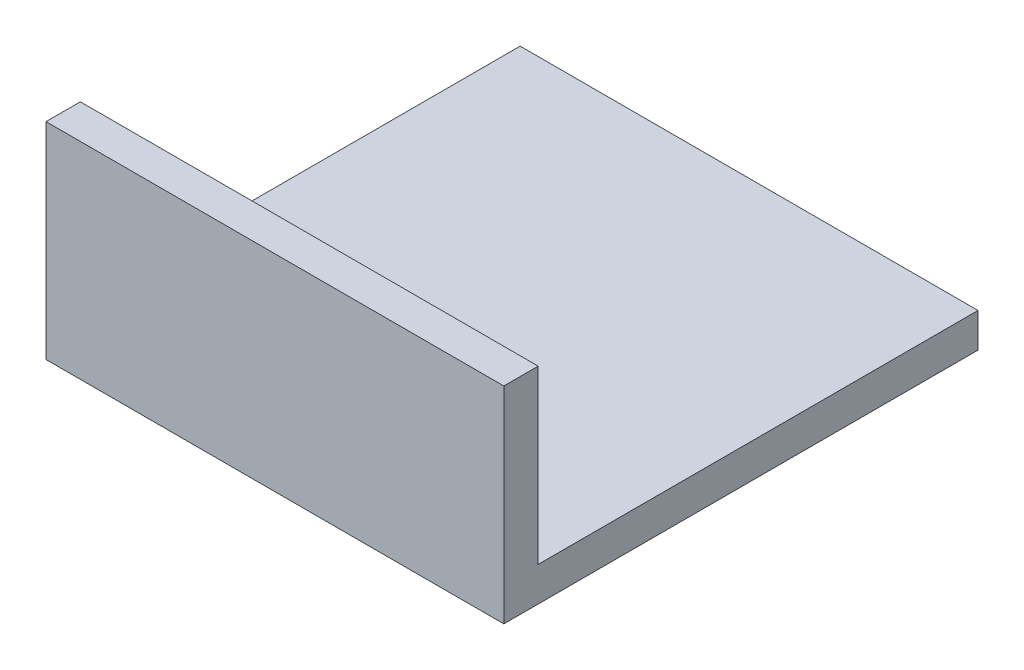
ISO-10303-21;
HEADER;
FILE_DESCRIPTION(('STEP AP214'),'2;1');
FILE_NAME('part.step','',(''),(''),'','','');
FILE_SCHEMA(('AUTOMOTIVE_DESIGN { 1 0 10303 214 1 1 1 1 }'));
ENDSEC;
DATA;
#1=APPLICATION_CONTEXT('core data for automotive mechanical design processes');
#2=APPLICATION_PROTOCOL_DEFINITION('international standard','automotive_design',2000,#1);
#3=PRODUCT_CONTEXT('',#1,'mechanical');
#4=PRODUCT('Part','Part','',(#3));
#5=PRODUCT_RELATED_PRODUCT_CATEGORY('part','',(#4));
#6=PRODUCT_DEFINITION_FORMATION('','',#4);
#7=PRODUCT_DEFINITION_CONTEXT('part definition',#1,'design');
#8=PRODUCT_DEFINITION('design','',#6,#7);
#9=PRODUCT_DEFINITION_SHAPE('','',#8);
#10=(LENGTH_UNIT() NAMED_UNIT(*) SI_UNIT(.MILLI.,.METRE.));
#11=(NAMED_UNIT(*) PLANE_ANGLE_UNIT() SI_UNIT($,.RADIAN.));
#12=(NAMED_UNIT(*) SI_UNIT($,.STERADIAN.) SOLID_ANGLE_UNIT());
#13=UNCERTAINTY_MEASURE_WITH_UNIT(LENGTH_MEASURE(1.E-05),#10,'distance_accuracy_value','');
#14=(GEOMETRIC_REPRESENTATION_CONTEXT(3) GLOBAL_UNCERTAINTY_ASSIGNED_CONTEXT((#13)) GLOBAL_UNIT_ASSIGNED_CONTEXT((#10,
#11,#12)) REPRESENTATION_CONTEXT('',''));
#15=CARTESIAN_POINT('',(0.,0.,0.));
#16=DIRECTION('',(0.,0.,1.));
#17=DIRECTION('',(1.,0.,0.));
#18=AXIS2_PLACEMENT_3D('',#15,#16,#17);
#19=CARTESIAN_POINT('',(0.,0.,0.));
#20=DIRECTION('',(0.,0.,-1.));
#21=DIRECTION('',(-1.,0.,0.));
#22=AXIS2_PLACEMENT_3D('',#19,#20,#21);
#23=PLANE('',#22);
#24=DIRECTION('',(0.,1.,0.));
#25=VECTOR('',#24,1.);
#26=CARTESIAN_POINT('',(127.,0.,0.));
#27=LINE('',#26,#25);
#28=CARTESIAN_POINT('',(127.,9.525,0.));
#29=VERTEX_POINT('',#28);
#30=CARTESIAN_POINT('',(127.,57.15,0.));
#31=VERTEX_POINT('',#30);
#32=EDGE_CURVE('E62',#29,#31,#27,.T.);
#33=ORIENTED_EDGE('',*,*,#32,.F.);
#34=DIRECTION('',(-1.,0.,0.));
#35=VECTOR('',#34,1.);
#36=CARTESIAN_POINT('',(0.,9.525,0.));
#37=LINE('',#36,#35);
#38=CARTESIAN_POINT('',(0.,9.525,0.));
#39=VERTEX_POINT('',#38);
#40=EDGE_CURVE('E11',#29,#39,#37,.T.);
#41=ORIENTED_EDGE('',*,*,#40,.T.);
#42=DIRECTION('',(0.,-1.,0.));
#43=VECTOR('',#42,1.);
#44=CARTESIAN_POINT('',(0.,0.,0.));
#45=LINE('',#44,#43);
#46=CARTESIAN_POINT('',(0.,57.15,0.));
#47=VERTEX_POINT('',#46);
#48=EDGE_CURVE('E106',#47,#39,#45,.T.);
#49=ORIENTED_EDGE('',*,*,#48,.F.);
#50=DIRECTION('',(-1.,0.,0.));
#51=VECTOR('',#50,1.);
#52=CARTESIAN_POINT('',(0.,57.15,0.));
#53=LINE('',#52,#51);
#54=EDGE_CURVE('E111',#31,#47,#53,.T.);
#55=ORIENTED_EDGE('',*,*,#54,.F.);
#56=EDGE_LOOP('',(#33,#41,#49,#55));
#57=FACE_BOUND('',#56,.T.);
#58=ADVANCED_FACE('F33',(#57),#23,.T.);
#59=CARTESIAN_POINT('',(0.,0.,9.525));
#60=DIRECTION('',(1.,0.,0.));
#61=DIRECTION('',(0.,0.,-1.));
#62=AXIS2_PLACEMENT_3D('',#59,#60,#61);
#63=PLANE('',#62);
#64=DIRECTION('',(0.,-1.,0.));
#65=VECTOR('',#64,1.);
#66=CARTESIAN_POINT('',(0.,9.525,-121.9962));
#67=LINE('',#66,#65);
#68=CARTESIAN_POINT('',(0.,9.525,-121.9962));
#69=VERTEX_POINT('',#68);
#70=CARTESIAN_POINT('',(0.,0.,-121.9962));
#71=VERTEX_POINT('',#70);
#72=EDGE_CURVE('E123',#69,#71,#67,.T.);
#73=ORIENTED_EDGE('',*,*,#72,.T.);
#74=DIRECTION('',(0.,0.,-1.));
#75=VECTOR('',#74,1.);
#76=CARTESIAN_POINT('',(0.,0.,9.525));
#77=LINE('',#76,#75);
#78=CARTESIAN_POINT('',(0.,0.,9.525));
#79=VERTEX_POINT('',#78);
#80=EDGE_CURVE('E42',#79,#71,#77,.T.);
#81=ORIENTED_EDGE('',*,*,#80,.F.);
#82=DIRECTION('',(0.,-1.,0.));
#83=VECTOR('',#82,1.);
#84=CARTESIAN_POINT('',(0.,0.,9.525));
#85=LINE('',#84,#83);
#86=CARTESIAN_POINT('',(0.,57.15,9.525));
#87=VERTEX_POINT('',#86);
#88=EDGE_CURVE('E84',#87,#79,#85,.T.);
#89=ORIENTED_EDGE('',*,*,#88,.F.);
#90=DIRECTION('',(0.,0.,-1.));
#91=VECTOR('',#90,1.);
#92=CARTESIAN_POINT('',(0.,57.15,9.525));
#93=LINE('',#92,#91);
#94=EDGE_CURVE('E102',#87,#47,#93,.T.);
#95=ORIENTED_EDGE('',*,*,#94,.T.);
#96=ORIENTED_EDGE('',*,*,#48,.T.);
#97=DIRECTION('',(0.,0.,1.));
#98=VECTOR('',#97,1.);
#99=CARTESIAN_POINT('',(0.,9.525,5.0038));
#100=LINE('',#99,#98);
#101=EDGE_CURVE('E125',#69,#39,#100,.T.);
#102=ORIENTED_EDGE('',*,*,#101,.F.);
#103=EDGE_LOOP('',(#73,#81,#89,#95,#96,#102));
#104=FACE_BOUND('',#103,.T.);
#105=ADVANCED_FACE('F35',(#104),#63,.F.);
#106=CARTESIAN_POINT('',(0.,0.,9.525));
#107=DIRECTION('',(0.,1.,0.));
#108=DIRECTION('',(0.,0.,1.));
#109=AXIS2_PLACEMENT_3D('',#106,#107,#108);
#110=PLANE('',#109);
#111=CARTESIAN_POINT('',(63.5,0.,-36.322));
#112=DIRECTION('',(0.,1.,0.));
#113=DIRECTION('',(0.,0.,1.));
#114=AXIS2_PLACEMENT_3D('',#111,#112,#113);
#115=CIRCLE('',#114,10.16);
#116=CARTESIAN_POINT('',(63.5,0.,-26.162));
#117=VERTEX_POINT('',#116);
#118=EDGE_CURVE('E137',#117,#117,#115,.T.);
#119=ORIENTED_EDGE('',*,*,#118,.T.);
#120=EDGE_LOOP('',(#119));
#121=FACE_BOUND('',#120,.T.);
#122=DIRECTION('',(-1.,0.,0.));
#123=VECTOR('',#122,1.);
#124=CARTESIAN_POINT('',(0.,0.,-121.9962));
#125=LINE('',#124,#123);
#126=CARTESIAN_POINT('',(127.,0.,-121.9962));
#127=VERTEX_POINT('',#126);
#128=EDGE_CURVE('E95',#127,#71,#125,.T.);
#129=ORIENTED_EDGE('',*,*,#128,.F.);
#130=DIRECTION('',(0.,0.,-1.));
#131=VECTOR('',#130,1.);
#132=CARTESIAN_POINT('',(127.,0.,9.525));
#133=LINE('',#132,#131);
#134=CARTESIAN_POINT('',(127.,0.,9.525));
#135=VERTEX_POINT('',#134);
#136=EDGE_CURVE('E91',#135,#127,#133,.T.);
#137=ORIENTED_EDGE('',*,*,#136,.F.);
#138=DIRECTION('',(1.,0.,0.));
#139=VECTOR('',#138,1.);
#140=CARTESIAN_POINT('',(0.,0.,9.525));
#141=LINE('',#140,#139);
#142=EDGE_CURVE('E78',#79,#135,#141,.T.);
#143=ORIENTED_EDGE('',*,*,#142,.F.);
#144=ORIENTED_EDGE('',*,*,#80,.T.);
#145=EDGE_LOOP('',(#129,#137,#143,#144));
#146=FACE_BOUND('',#145,.T.);
#147=ADVANCED_FACE('F92',(#121,#146),#110,.F.);
#148=CARTESIAN_POINT('',(127.,0.,9.525));
#149=DIRECTION('',(-1.,0.,0.));
#150=DIRECTION('',(0.,0.,1.));
#151=AXIS2_PLACEMENT_3D('',#148,#149,#150);
#152=PLANE('',#151);
#153=ORIENTED_EDGE('',*,*,#136,.T.);
#154=DIRECTION('',(0.,-1.,0.));
#155=VECTOR('',#154,1.);
#156=CARTESIAN_POINT('',(127.,9.525,-121.9962));
#157=LINE('',#156,#155);
#158=CARTESIAN_POINT('',(127.,9.525,-121.9962));
#159=VERTEX_POINT('',#158);
#160=EDGE_CURVE('E109',#159,#127,#157,.T.);
#161=ORIENTED_EDGE('',*,*,#160,.F.);
#162=DIRECTION('',(0.,0.,-1.));
#163=VECTOR('',#162,1.);
#164=CARTESIAN_POINT('',(127.,9.525,5.0038));
#165=LINE('',#164,#163);
#166=EDGE_CURVE('E132',#29,#159,#165,.T.);
#167=ORIENTED_EDGE('',*,*,#166,.F.);
#168=ORIENTED_EDGE('',*,*,#32,.T.);
#169=DIRECTION('',(0.,0.,-1.));
#170=VECTOR('',#169,1.);
#171=CARTESIAN_POINT('',(127.,57.15,9.525));
#172=LINE('',#171,#170);
#173=CARTESIAN_POINT('',(127.,57.15,9.525));
#174=VERTEX_POINT('',#173);
#175=EDGE_CURVE('E98',#174,#31,#172,.T.);
#176=ORIENTED_EDGE('',*,*,#175,.F.);
#177=DIRECTION('',(0.,1.,0.));
#178=VECTOR('',#177,1.);
#179=CARTESIAN_POINT('',(127.,0.,9.525));
#180=LINE('',#179,#178);
#181=EDGE_CURVE('E82',#135,#174,#180,.T.);
#182=ORIENTED_EDGE('',*,*,#181,.F.);
#183=EDGE_LOOP('',(#153,#161,#167,#168,#176,#182));
#184=FACE_BOUND('',#183,.T.);
#185=ADVANCED_FACE('F100',(#184),#152,.F.);
#186=CARTESIAN_POINT('',(0.,57.15,9.525));
#187=DIRECTION('',(0.,-1.,0.));
#188=DIRECTION('',(0.,0.,-1.));
#189=AXIS2_PLACEMENT_3D('',#186,#187,#188);
#190=PLANE('',#189);
#191=ORIENTED_EDGE('',*,*,#54,.T.);
#192=ORIENTED_EDGE('',*,*,#94,.F.);
#193=DIRECTION('',(-1.,0.,0.));
#194=VECTOR('',#193,1.);
#195=CARTESIAN_POINT('',(0.,57.15,9.525));
#196=LINE('',#195,#194);
#197=EDGE_CURVE('E50',#174,#87,#196,.T.);
#198=ORIENTED_EDGE('',*,*,#197,.F.);
#199=ORIENTED_EDGE('',*,*,#175,.T.);
#200=EDGE_LOOP('',(#191,#192,#198,#199));
#201=FACE_BOUND('',#200,.T.);
#202=ADVANCED_FACE('F163',(#201),#190,.F.);
#203=CARTESIAN_POINT('',(0.,0.,9.525));
#204=DIRECTION('',(0.,0.,-1.));
#205=DIRECTION('',(-1.,0.,0.));
#206=AXIS2_PLACEMENT_3D('',#203,#204,#205);
#207=PLANE('',#206);
#208=ORIENTED_EDGE('',*,*,#88,.T.);
#209=ORIENTED_EDGE('',*,*,#142,.T.);
#210=ORIENTED_EDGE('',*,*,#181,.T.);
#211=ORIENTED_EDGE('',*,*,#197,.T.);
#212=EDGE_LOOP('',(#208,#209,#210,#211));
#213=FACE_BOUND('',#212,.T.);
#214=ADVANCED_FACE('F80',(#213),#207,.F.);
#215=CARTESIAN_POINT('',(0.,9.525,-121.9962));
#216=DIRECTION('',(0.,0.,1.));
#217=DIRECTION('',(1.,0.,0.));
#218=AXIS2_PLACEMENT_3D('',#215,#216,#217);
#219=PLANE('',#218);
#220=ORIENTED_EDGE('',*,*,#128,.T.);
#221=ORIENTED_EDGE('',*,*,#72,.F.);
#222=DIRECTION('',(-1.,0.,0.));
#223=VECTOR('',#222,1.);
#224=CARTESIAN_POINT('',(0.,9.525,-121.9962));
#225=LINE('',#224,#223);
#226=EDGE_CURVE('E128',#159,#69,#225,.T.);
#227=ORIENTED_EDGE('',*,*,#226,.F.);
#228=ORIENTED_EDGE('',*,*,#160,.T.);
#229=EDGE_LOOP('',(#220,#221,#227,#228));
#230=FACE_BOUND('',#229,.T.);
#231=ADVANCED_FACE('F121',(#230),#219,.F.);
#232=CARTESIAN_POINT('',(0.,9.525,0.));
#233=DIRECTION('',(0.,-1.,0.));
#234=DIRECTION('',(0.,0.,-1.));
#235=AXIS2_PLACEMENT_3D('',#232,#233,#234);
#236=PLANE('',#235);
#237=ORIENTED_EDGE('',*,*,#40,.F.);
#238=ORIENTED_EDGE('',*,*,#166,.T.);
#239=ORIENTED_EDGE('',*,*,#226,.T.);
#240=ORIENTED_EDGE('',*,*,#101,.T.);
#241=EDGE_LOOP('',(#237,#238,#239,#240));
#242=FACE_BOUND('',#241,.T.);
#243=ADVANCED_FACE('F152',(#242),#236,.F.);
#244=CARTESIAN_POINT('',(63.5,5.0038,-36.322));
#245=DIRECTION('',(0.,-1.,0.));
#246=DIRECTION('',(0.,0.,-1.));
#247=AXIS2_PLACEMENT_3D('',#244,#245,#246);
#248=CYLINDRICAL_SURFACE('',#247,10.16);
#249=CARTESIAN_POINT('',(63.5,5.0038,-36.322));
#250=DIRECTION('',(0.,1.,0.));
#251=DIRECTION('',(0.,0.,1.));
#252=AXIS2_PLACEMENT_3D('',#249,#250,#251);
#253=CIRCLE('',#252,10.16);
#254=CARTESIAN_POINT('',(63.5,5.0038,-26.162));
#255=VERTEX_POINT('',#254);
#256=EDGE_CURVE('E126',#255,#255,#253,.T.);
#257=ORIENTED_EDGE('',*,*,#256,.T.);
#258=EDGE_LOOP('',(#257));
#259=FACE_BOUND('',#258,.T.);
#260=ORIENTED_EDGE('',*,*,#118,.F.);
#261=EDGE_LOOP('',(#260));
#262=FACE_BOUND('',#261,.T.);
#263=ADVANCED_FACE('F143',(#259,#262),#248,.F.);
#264=CARTESIAN_POINT('',(63.5,5.0038,-36.322));
#265=DIRECTION('',(0.,1.,0.));
#266=DIRECTION('',(0.,0.,1.));
#267=AXIS2_PLACEMENT_3D('',#264,#265,#266);
#268=PLANE('',#267);
#269=ORIENTED_EDGE('',*,*,#256,.F.);
#270=EDGE_LOOP('',(#269));
#271=FACE_BOUND('',#270,.T.);
#272=ADVANCED_FACE('F146',(#271),#268,.F.);
#273=CLOSED_SHELL('',(#58,#105,#147,#185,#202,#214,#231,#243,#263,#272));
#274=MANIFOLD_SOLID_BREP('B2',#273);
#275=ADVANCED_BREP_SHAPE_REPRESENTATION('',(#18,#274),#14);
#276=SHAPE_DEFINITION_REPRESENTATION(#9,#275);
ENDSEC;
END-ISO-10303-21;
